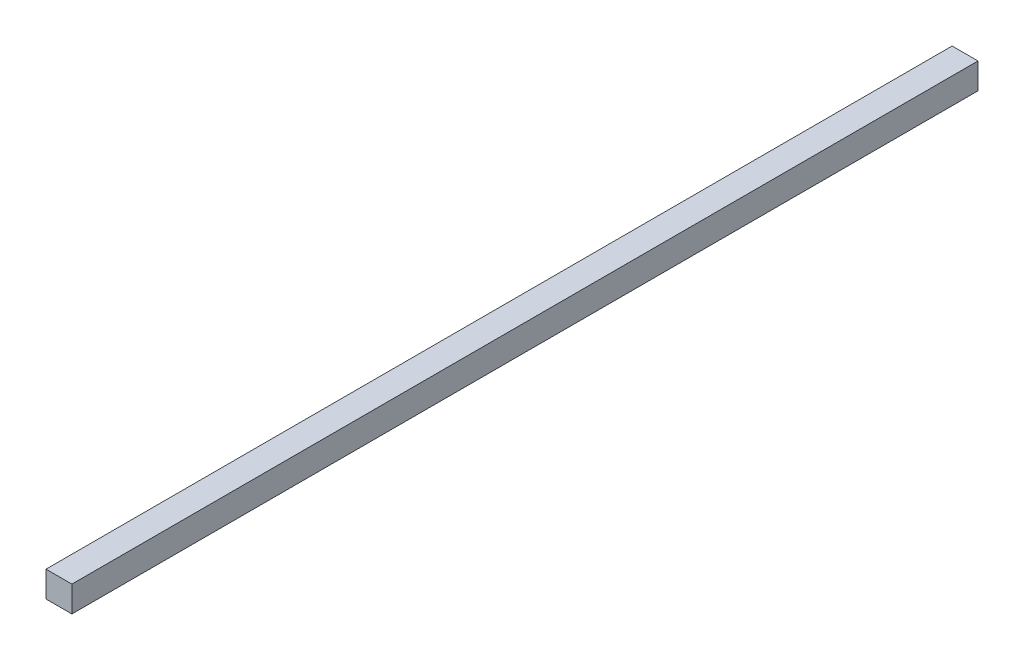
ISO-10303-21;
HEADER;
FILE_DESCRIPTION(('STEP AP214'),'2;1');
FILE_NAME('part.step','',(''),(''),'','','');
FILE_SCHEMA(('AUTOMOTIVE_DESIGN { 1 0 10303 214 1 1 1 1 }'));
ENDSEC;
DATA;
#1=APPLICATION_CONTEXT('core data for automotive mechanical design processes');
#2=APPLICATION_PROTOCOL_DEFINITION('international standard','automotive_design',2000,#1);
#3=PRODUCT_CONTEXT('',#1,'mechanical');
#4=PRODUCT('Part','Part','',(#3));
#5=PRODUCT_RELATED_PRODUCT_CATEGORY('part','',(#4));
#6=PRODUCT_DEFINITION_FORMATION('','',#4);
#7=PRODUCT_DEFINITION_CONTEXT('part definition',#1,'design');
#8=PRODUCT_DEFINITION('design','',#6,#7);
#9=PRODUCT_DEFINITION_SHAPE('','',#8);
#10=(LENGTH_UNIT() NAMED_UNIT(*) SI_UNIT(.MILLI.,.METRE.));
#11=(NAMED_UNIT(*) PLANE_ANGLE_UNIT() SI_UNIT($,.RADIAN.));
#12=(NAMED_UNIT(*) SI_UNIT($,.STERADIAN.) SOLID_ANGLE_UNIT());
#13=UNCERTAINTY_MEASURE_WITH_UNIT(LENGTH_MEASURE(1.E-05),#10,'distance_accuracy_value','');
#14=(GEOMETRIC_REPRESENTATION_CONTEXT(3) GLOBAL_UNCERTAINTY_ASSIGNED_CONTEXT((#13)) GLOBAL_UNIT_ASSIGNED_CONTEXT((#10,
#11,#12)) REPRESENTATION_CONTEXT('',''));
#15=CARTESIAN_POINT('',(0.,0.,0.));
#16=DIRECTION('',(0.,0.,1.));
#17=DIRECTION('',(1.,0.,0.));
#18=AXIS2_PLACEMENT_3D('',#15,#16,#17);
#19=CARTESIAN_POINT('',(-5.,5.,350.));
#20=DIRECTION('',(1.,0.,0.));
#21=DIRECTION('',(0.,0.,-1.));
#22=AXIS2_PLACEMENT_3D('',#19,#20,#21);
#23=PLANE('',#22);
#24=DIRECTION('',(0.,-1.,0.));
#25=VECTOR('',#24,1.);
#26=CARTESIAN_POINT('',(-5.,5.,0.));
#27=LINE('',#26,#25);
#28=CARTESIAN_POINT('',(-5.,5.,0.));
#29=VERTEX_POINT('',#28);
#30=CARTESIAN_POINT('',(-5.,-5.,0.));
#31=VERTEX_POINT('',#30);
#32=EDGE_CURVE('E111',#29,#31,#27,.T.);
#33=ORIENTED_EDGE('',*,*,#32,.T.);
#34=DIRECTION('',(0.,0.,-1.));
#35=VECTOR('',#34,1.);
#36=CARTESIAN_POINT('',(-5.,-5.,350.));
#37=LINE('',#36,#35);
#38=CARTESIAN_POINT('',(-5.,-5.,350.));
#39=VERTEX_POINT('',#38);
#40=EDGE_CURVE('E11',#39,#31,#37,.T.);
#41=ORIENTED_EDGE('',*,*,#40,.F.);
#42=DIRECTION('',(0.,-1.,0.));
#43=VECTOR('',#42,1.);
#44=CARTESIAN_POINT('',(-5.,5.,350.));
#45=LINE('',#44,#43);
#46=CARTESIAN_POINT('',(-5.,5.,350.));
#47=VERTEX_POINT('',#46);
#48=EDGE_CURVE('E95',#47,#39,#45,.T.);
#49=ORIENTED_EDGE('',*,*,#48,.F.);
#50=DIRECTION('',(0.,0.,-1.));
#51=VECTOR('',#50,1.);
#52=CARTESIAN_POINT('',(-5.,5.,350.));
#53=LINE('',#52,#51);
#54=EDGE_CURVE('E107',#47,#29,#53,.T.);
#55=ORIENTED_EDGE('',*,*,#54,.T.);
#56=EDGE_LOOP('',(#33,#41,#49,#55));
#57=FACE_BOUND('',#56,.T.);
#58=ADVANCED_FACE('F43',(#57),#23,.F.);
#59=CARTESIAN_POINT('',(-5.,-5.,350.));
#60=DIRECTION('',(0.,1.,0.));
#61=DIRECTION('',(0.,0.,1.));
#62=AXIS2_PLACEMENT_3D('',#59,#60,#61);
#63=PLANE('',#62);
#64=DIRECTION('',(1.,0.,0.));
#65=VECTOR('',#64,1.);
#66=CARTESIAN_POINT('',(-5.,-5.,0.));
#67=LINE('',#66,#65);
#68=CARTESIAN_POINT('',(5.,-5.,0.));
#69=VERTEX_POINT('',#68);
#70=EDGE_CURVE('E100',#31,#69,#67,.T.);
#71=ORIENTED_EDGE('',*,*,#70,.T.);
#72=DIRECTION('',(0.,0.,-1.));
#73=VECTOR('',#72,1.);
#74=CARTESIAN_POINT('',(5.,-5.,350.));
#75=LINE('',#74,#73);
#76=CARTESIAN_POINT('',(5.,-5.,350.));
#77=VERTEX_POINT('',#76);
#78=EDGE_CURVE('E52',#77,#69,#75,.T.);
#79=ORIENTED_EDGE('',*,*,#78,.F.);
#80=DIRECTION('',(1.,0.,0.));
#81=VECTOR('',#80,1.);
#82=CARTESIAN_POINT('',(-5.,-5.,350.));
#83=LINE('',#82,#81);
#84=EDGE_CURVE('E90',#39,#77,#83,.T.);
#85=ORIENTED_EDGE('',*,*,#84,.F.);
#86=ORIENTED_EDGE('',*,*,#40,.T.);
#87=EDGE_LOOP('',(#71,#79,#85,#86));
#88=FACE_BOUND('',#87,.T.);
#89=ADVANCED_FACE('F99',(#88),#63,.F.);
#90=CARTESIAN_POINT('',(5.,5.,350.));
#91=DIRECTION('',(-1.,0.,0.));
#92=DIRECTION('',(0.,-1.,0.));
#93=AXIS2_PLACEMENT_3D('',#90,#91,#92);
#94=PLANE('',#93);
#95=DIRECTION('',(0.,1.,0.));
#96=VECTOR('',#95,1.);
#97=CARTESIAN_POINT('',(5.,5.,0.));
#98=LINE('',#97,#96);
#99=CARTESIAN_POINT('',(5.,5.,0.));
#100=VERTEX_POINT('',#99);
#101=EDGE_CURVE('E77',#69,#100,#98,.T.);
#102=ORIENTED_EDGE('',*,*,#101,.T.);
#103=DIRECTION('',(0.,0.,-1.));
#104=VECTOR('',#103,1.);
#105=CARTESIAN_POINT('',(5.,5.,350.));
#106=LINE('',#105,#104);
#107=CARTESIAN_POINT('',(5.,5.,350.));
#108=VERTEX_POINT('',#107);
#109=EDGE_CURVE('E102',#108,#100,#106,.T.);
#110=ORIENTED_EDGE('',*,*,#109,.F.);
#111=DIRECTION('',(0.,1.,0.));
#112=VECTOR('',#111,1.);
#113=CARTESIAN_POINT('',(5.,5.,350.));
#114=LINE('',#113,#112);
#115=EDGE_CURVE('E93',#77,#108,#114,.T.);
#116=ORIENTED_EDGE('',*,*,#115,.F.);
#117=ORIENTED_EDGE('',*,*,#78,.T.);
#118=EDGE_LOOP('',(#102,#110,#116,#117));
#119=FACE_BOUND('',#118,.T.);
#120=ADVANCED_FACE('F103',(#119),#94,.F.);
#121=CARTESIAN_POINT('',(-5.,5.,350.));
#122=DIRECTION('',(0.,-1.,0.));
#123=DIRECTION('',(1.,0.,0.));
#124=AXIS2_PLACEMENT_3D('',#121,#122,#123);
#125=PLANE('',#124);
#126=DIRECTION('',(-1.,0.,0.));
#127=VECTOR('',#126,1.);
#128=CARTESIAN_POINT('',(-5.,5.,0.));
#129=LINE('',#128,#127);
#130=EDGE_CURVE('E83',#100,#29,#129,.T.);
#131=ORIENTED_EDGE('',*,*,#130,.T.);
#132=ORIENTED_EDGE('',*,*,#54,.F.);
#133=DIRECTION('',(-1.,0.,0.));
#134=VECTOR('',#133,1.);
#135=CARTESIAN_POINT('',(-5.,5.,350.));
#136=LINE('',#135,#134);
#137=EDGE_CURVE('E60',#108,#47,#136,.T.);
#138=ORIENTED_EDGE('',*,*,#137,.F.);
#139=ORIENTED_EDGE('',*,*,#109,.T.);
#140=EDGE_LOOP('',(#131,#132,#138,#139));
#141=FACE_BOUND('',#140,.T.);
#142=ADVANCED_FACE('F124',(#141),#125,.F.);
#143=CARTESIAN_POINT('',(0.,0.,350.));
#144=DIRECTION('',(0.,0.,1.));
#145=DIRECTION('',(1.,0.,0.));
#146=AXIS2_PLACEMENT_3D('',#143,#144,#145);
#147=PLANE('',#146);
#148=ORIENTED_EDGE('',*,*,#48,.T.);
#149=ORIENTED_EDGE('',*,*,#84,.T.);
#150=ORIENTED_EDGE('',*,*,#115,.T.);
#151=ORIENTED_EDGE('',*,*,#137,.T.);
#152=EDGE_LOOP('',(#148,#149,#150,#151));
#153=FACE_BOUND('',#152,.T.);
#154=ADVANCED_FACE('F91',(#153),#147,.T.);
#155=CARTESIAN_POINT('',(0.,0.,0.));
#156=DIRECTION('',(0.,0.,1.));
#157=DIRECTION('',(1.,0.,0.));
#158=AXIS2_PLACEMENT_3D('',#155,#156,#157);
#159=PLANE('',#158);
#160=ORIENTED_EDGE('',*,*,#32,.F.);
#161=ORIENTED_EDGE('',*,*,#130,.F.);
#162=ORIENTED_EDGE('',*,*,#101,.F.);
#163=ORIENTED_EDGE('',*,*,#70,.F.);
#164=EDGE_LOOP('',(#160,#161,#162,#163));
#165=FACE_BOUND('',#164,.T.);
#166=ADVANCED_FACE('F127',(#165),#159,.F.);
#167=CLOSED_SHELL('',(#58,#89,#120,#142,#154,#166));
#168=MANIFOLD_SOLID_BREP('B2',#167);
#169=ADVANCED_BREP_SHAPE_REPRESENTATION('',(#18,#168),#14);
#170=SHAPE_DEFINITION_REPRESENTATION(#9,#169);
ENDSEC;
END-ISO-10303-21;
